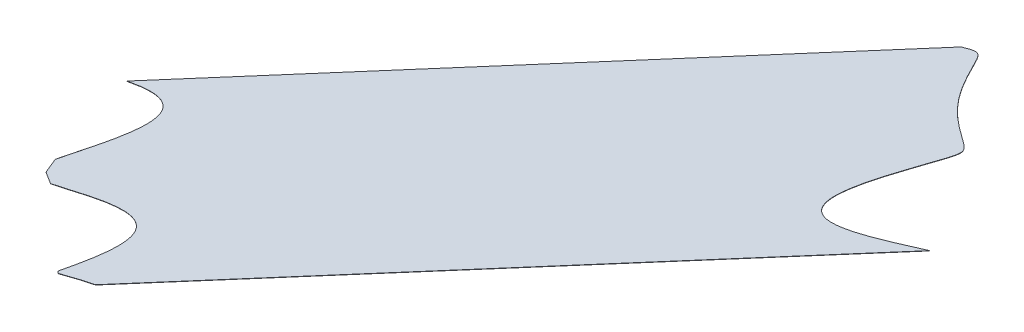
ISO-10303-21;
HEADER;
FILE_DESCRIPTION(('STEP AP214'),'2;1');
FILE_NAME('part.step','',(''),(''),'','','');
FILE_SCHEMA(('AUTOMOTIVE_DESIGN { 1 0 10303 214 1 1 1 1 }'));
ENDSEC;
DATA;
#1=APPLICATION_CONTEXT('core data for automotive mechanical design processes');
#2=APPLICATION_PROTOCOL_DEFINITION('international standard','automotive_design',2000,#1);
#3=PRODUCT_CONTEXT('',#1,'mechanical');
#4=PRODUCT('Part','Part','',(#3));
#5=PRODUCT_RELATED_PRODUCT_CATEGORY('part','',(#4));
#6=PRODUCT_DEFINITION_FORMATION('','',#4);
#7=PRODUCT_DEFINITION_CONTEXT('part definition',#1,'design');
#8=PRODUCT_DEFINITION('design','',#6,#7);
#9=PRODUCT_DEFINITION_SHAPE('','',#8);
#10=(LENGTH_UNIT() NAMED_UNIT(*) SI_UNIT(.MILLI.,.METRE.));
#11=(NAMED_UNIT(*) PLANE_ANGLE_UNIT() SI_UNIT($,.RADIAN.));
#12=(NAMED_UNIT(*) SI_UNIT($,.STERADIAN.) SOLID_ANGLE_UNIT());
#13=UNCERTAINTY_MEASURE_WITH_UNIT(LENGTH_MEASURE(1.E-05),#10,'distance_accuracy_value','');
#14=(GEOMETRIC_REPRESENTATION_CONTEXT(3) GLOBAL_UNCERTAINTY_ASSIGNED_CONTEXT((#13)) GLOBAL_UNIT_ASSIGNED_CONTEXT((#10,
#11,#12)) REPRESENTATION_CONTEXT('',''));
#15=CARTESIAN_POINT('',(0.,0.,0.));
#16=DIRECTION('',(0.,0.,1.));
#17=DIRECTION('',(1.,0.,0.));
#18=AXIS2_PLACEMENT_3D('',#15,#16,#17);
#19=CARTESIAN_POINT('',(2526.18612442201,154.997925680806,134.147987479624));
#20=DIRECTION('',(-0.636420404011801,0.0609268060007244,-0.76893237262324));
#21=DIRECTION('',(-0.770363525853528,0.,0.637604923157374));
#22=AXIS2_PLACEMENT_3D('',#19,#20,#21);
#23=PLANE('',#22);
#24=DIRECTION('',(0.769416763227082,0.120539805596336,-0.627270276461398));
#25=VECTOR('',#24,1.);
#26=CARTESIAN_POINT('',(2526.19157136044,154.898841974801,134.13562826986));
#27=LINE('',#26,#25);
#28=CARTESIAN_POINT('',(2526.19157136044,154.898841974801,134.13562826986));
#29=VERTEX_POINT('',#28);
#30=CARTESIAN_POINT('',(2684.13136642013,179.642301049661,5.37454111102499));
#31=VERTEX_POINT('',#30);
#32=EDGE_CURVE('E161',#29,#31,#27,.T.);
#33=ORIENTED_EDGE('',*,*,#32,.F.);
#34=DIRECTION('',(0.0544693842687489,-0.990837060054451,-0.123592097643965));
#35=VECTOR('',#34,1.);
#36=CARTESIAN_POINT('',(2526.18612442201,154.997925680806,134.147987479624));
#37=LINE('',#36,#35);
#38=CARTESIAN_POINT('',(2526.18612442201,154.997925680806,134.147987479624));
#39=VERTEX_POINT('',#38);
#40=EDGE_CURVE('E13',#39,#29,#37,.T.);
#41=ORIENTED_EDGE('',*,*,#40,.F.);
#42=DIRECTION('',(0.769416763227082,0.120539805596336,-0.627270276461398));
#43=VECTOR('',#42,1.);
#44=CARTESIAN_POINT('',(2526.18612442201,154.997925680806,134.147987479624));
#45=LINE('',#44,#43);
#46=CARTESIAN_POINT('',(2684.1259194817,179.741384755666,5.38690032078939));
#47=VERTEX_POINT('',#46);
#48=EDGE_CURVE('E227',#39,#47,#45,.T.);
#49=ORIENTED_EDGE('',*,*,#48,.T.);
#50=DIRECTION('',(0.0544693842687489,-0.990837060054451,-0.123592097643965));
#51=VECTOR('',#50,1.);
#52=CARTESIAN_POINT('',(2684.1259194817,179.741384755666,5.38690032078939));
#53=LINE('',#52,#51);
#54=EDGE_CURVE('E110',#47,#31,#53,.T.);
#55=ORIENTED_EDGE('',*,*,#54,.T.);
#56=EDGE_LOOP('',(#33,#41,#49,#55));
#57=FACE_BOUND('',#56,.T.);
#58=ADVANCED_FACE('F56',(#57),#23,.T.);
#59=CARTESIAN_POINT('',(2526.18612442201,154.997925680806,134.147987479624));
#60=CARTESIAN_POINT('',(2527.74584101399,155.113006093001,133.912785266505));
#61=CARTESIAN_POINT('',(2529.12018096937,155.205204682554,133.779327476054));
#62=CARTESIAN_POINT('',(2530.70036815862,155.311212682619,133.62588051415));
#63=CARTESIAN_POINT('',(2532.06566331949,155.389004789134,133.603933193824));
#64=CARTESIAN_POINT('',(2533.69095169273,155.48161084962,133.577806444406));
#65=CARTESIAN_POINT('',(2535.03808710249,155.535734204732,133.737608006263));
#66=CARTESIAN_POINT('',(2536.68012895446,155.601705905586,133.93239232466));
#67=CARTESIAN_POINT('',(2537.9351944785,155.611540457041,134.406679996598));
#68=CARTESIAN_POINT('',(2539.46409484854,155.623520747368,134.984449510008));
#69=CARTESIAN_POINT('',(2540.96744021771,155.514491135964,136.52109206115));
#70=CARTESIAN_POINT('',(2541.69378000524,155.394076599676,137.806566368557));
#71=CARTESIAN_POINT('',(2541.91270004164,155.313259191527,138.550961232247));
#72=CARTESIAN_POINT('',(2542.29045114621,155.173807062343,139.835430148932));
#73=CARTESIAN_POINT('',(2542.26598324431,154.967227528617,141.4807934868));
#74=CARTESIAN_POINT('',(2542.24608597631,154.799237303549,142.818800947956));
#75=CARTESIAN_POINT('',(2541.96009800397,154.584627551489,144.413285634158));
#76=CARTESIAN_POINT('',(2541.72191587425,154.405892035492,145.741235740815));
#77=CARTESIAN_POINT('',(2541.29605020046,154.192464781245,147.26459359047));
#78=CARTESIAN_POINT('',(2540.92753432657,154.007779008354,148.582806312858));
#79=CARTESIAN_POINT('',(2540.41278524443,153.794282185848,150.067549284975));
#80=CARTESIAN_POINT('',(2539.96429749972,153.608267850416,151.361167962774));
#81=CARTESIAN_POINT('',(2539.39542158973,153.39652432958,152.808000005733));
#82=CARTESIAN_POINT('',(2538.8977102795,153.211269261939,154.073837878486));
#83=CARTESIAN_POINT('',(2538.29048479369,152.999915775266,155.500641633774));
#84=CARTESIAN_POINT('',(2537.76966199564,152.818635975788,156.724424135426));
#85=CARTESIAN_POINT('',(2537.12523626788,152.603322511122,158.166580156076));
#86=CARTESIAN_POINT('',(2536.85054073258,152.511542116756,158.781319454977));
#87=CARTESIAN_POINT('',(2536.52703786203,152.404756606465,159.494844353294));
#88=CARTESIAN_POINT('',(2536.28130634098,152.323642748574,160.036835088245));
#89=CARTESIAN_POINT('',(2535.92238754405,152.205880023118,160.822755779413));
#90=CARTESIAN_POINT('',(2535.36763722174,152.023864173122,162.037486689209));
#91=CARTESIAN_POINT('',(2535.31510150696,152.006593612383,162.152791177626));
#92=CARTESIAN_POINT('',(2534.95369623408,151.887785450319,162.945997290264));
#93=CARTESIAN_POINT('',(2534.71116529873,151.806868094609,163.487823227367));
#94=CARTESIAN_POINT('',(2534.36646628782,151.691863662543,164.2578976277));
#95=CARTESIAN_POINT('',(2534.12268133216,151.607112846838,164.829903718617));
#96=CARTESIAN_POINT('',(2533.78774337376,151.490673072658,165.615787128729));
#97=CARTESIAN_POINT('',(2533.57448051185,151.407438692909,166.18908762853));
#98=B_SPLINE_CURVE_WITH_KNOTS('',2,(#59,#60,#61,#62,#63,#64,#65,#66,#67,#68,#69,#70,#71,#72,#73,
#74,#75,#76,#77,#78,#79,#80,#81,#82,#83,#84,#85,#86,#87,#88,#89,#90,#91,#92,#93,#94,#95,#96,
#97),.UNSPECIFIED.,.F.,.F.,(3,2,2,2,2,1,1,2,2,2,2,2,2,2,2,2,2,2,2,2,3),(0.,0.0625,0.125,0.1875,
0.25,0.3125,0.34375,0.375,0.4375,0.5,0.5625,0.625,0.6875,0.75,0.8125,0.84375,0.875,0.90625,
0.9375,0.96875,1.),.UNSPECIFIED.);
#99=DIRECTION('',(0.0544693842687489,-0.990837060054451,-0.123592097643965));
#100=VECTOR('',#99,1.);
#101=SURFACE_OF_LINEAR_EXTRUSION('',#98,#100);
#102=CARTESIAN_POINT('',(2526.19157136044,154.898841974801,134.13562826986));
#103=CARTESIAN_POINT('',(2527.75128795242,155.013922386995,133.90042605674));
#104=CARTESIAN_POINT('',(2529.12562790779,155.106120976548,133.76696826629));
#105=CARTESIAN_POINT('',(2530.70581509704,155.212128976613,133.613521304386));
#106=CARTESIAN_POINT('',(2532.07111025791,155.289921083128,133.59157398406));
#107=CARTESIAN_POINT('',(2533.69639863116,155.382527143614,133.565447234641));
#108=CARTESIAN_POINT('',(2535.04353404092,155.436650498726,133.725248796498));
#109=CARTESIAN_POINT('',(2536.68557589288,155.50262219958,133.920033114895));
#110=CARTESIAN_POINT('',(2537.94064141693,155.512456751035,134.394320786834));
#111=CARTESIAN_POINT('',(2539.46954178697,155.524437041363,134.972090300244));
#112=CARTESIAN_POINT('',(2540.97288715614,155.415407429959,136.508732851386));
#113=CARTESIAN_POINT('',(2541.69922694367,155.294992893671,137.794207158792));
#114=CARTESIAN_POINT('',(2541.91814698007,155.214175485521,138.538602022482));
#115=CARTESIAN_POINT('',(2542.29589808464,155.074723356338,139.823070939167));
#116=CARTESIAN_POINT('',(2542.27143018274,154.868143822612,141.468434277035));
#117=CARTESIAN_POINT('',(2542.25153291474,154.700153597544,142.806441738192));
#118=CARTESIAN_POINT('',(2541.9655449424,154.485543845484,144.400926424394));
#119=CARTESIAN_POINT('',(2541.72736281267,154.306808329486,145.72887653105));
#120=CARTESIAN_POINT('',(2541.30149713889,154.093381075239,147.252234380706));
#121=CARTESIAN_POINT('',(2540.932981265,153.908695302348,148.570447103094));
#122=CARTESIAN_POINT('',(2540.41823218286,153.695198479842,150.05519007521));
#123=CARTESIAN_POINT('',(2539.96974443815,153.509184144411,151.348808753009));
#124=CARTESIAN_POINT('',(2539.40086852815,153.297440623575,152.795640795968));
#125=CARTESIAN_POINT('',(2538.90315721793,153.112185555933,154.061478668722));
#126=CARTESIAN_POINT('',(2538.29593173211,152.90083206926,155.48828242401));
#127=CARTESIAN_POINT('',(2537.77510893406,152.719552269782,156.712064925662));
#128=CARTESIAN_POINT('',(2537.13068320631,152.504238805116,158.154220946312));
#129=CARTESIAN_POINT('',(2536.85598767101,152.41245841075,158.768960245212));
#130=CARTESIAN_POINT('',(2536.53248480046,152.30567290046,159.48248514353));
#131=CARTESIAN_POINT('',(2536.28675327941,152.224559042568,160.024475878481));
#132=CARTESIAN_POINT('',(2535.92783448248,152.106796317113,160.810396569649));
#133=CARTESIAN_POINT('',(2535.37308416017,151.924780467116,162.025127479444));
#134=CARTESIAN_POINT('',(2535.32054844538,151.907509906378,162.140431967862));
#135=CARTESIAN_POINT('',(2534.95914317251,151.788701744314,162.933638080499));
#136=CARTESIAN_POINT('',(2534.71661223716,151.707784388603,163.475464017602));
#137=CARTESIAN_POINT('',(2534.37191322624,151.592779956537,164.245538417935));
#138=CARTESIAN_POINT('',(2534.12812827059,151.508029140833,164.817544508853));
#139=CARTESIAN_POINT('',(2533.79319031218,151.391589366653,165.603427918964));
#140=CARTESIAN_POINT('',(2533.57992745027,151.308354986904,166.176728418765));
#141=B_SPLINE_CURVE_WITH_KNOTS('',2,(#102,#103,#104,#105,#106,#107,#108,#109,#110,#111,#112,
#113,#114,#115,#116,#117,#118,#119,#120,#121,#122,#123,#124,#125,#126,#127,#128,#129,#130,#131,
#132,#133,#134,#135,#136,#137,#138,#139,#140),.UNSPECIFIED.,.F.,.F.,(3,2,2,2,2,1,1,2,2,2,2,2,2,
2,2,2,2,2,2,2,3),(0.,0.0625,0.125,0.1875,0.25,0.3125,0.34375,0.375,0.4375,0.5,0.5625,0.625,
0.6875,0.75,0.8125,0.84375,0.875,0.90625,0.9375,0.96875,1.),.UNSPECIFIED.);
#142=CARTESIAN_POINT('',(2533.57992771344,151.308354910784,166.176729144992));
#143=VERTEX_POINT('',#142);
#144=EDGE_CURVE('E263',#29,#143,#141,.T.);
#145=ORIENTED_EDGE('',*,*,#144,.T.);
#146=DIRECTION('',(0.0544693842687489,-0.990837060054451,-0.123592097643965));
#147=VECTOR('',#146,1.);
#148=CARTESIAN_POINT('',(2533.57448077501,151.40743861679,166.189088354756));
#149=LINE('',#148,#147);
#150=CARTESIAN_POINT('',(2533.57448077501,151.40743861679,166.189088354756));
#151=VERTEX_POINT('',#150);
#152=EDGE_CURVE('E64',#151,#143,#149,.T.);
#153=ORIENTED_EDGE('',*,*,#152,.F.);
#154=EDGE_CURVE('E222',#39,#151,#98,.T.);
#155=ORIENTED_EDGE('',*,*,#154,.F.);
#156=ORIENTED_EDGE('',*,*,#40,.T.);
#157=EDGE_LOOP('',(#145,#153,#155,#156));
#158=FACE_BOUND('',#157,.T.);
#159=ADVANCED_FACE('F218',(#158),#101,.F.);
#160=CARTESIAN_POINT('',(2533.57448051187,151.407438692909,166.189087628538));
#161=CARTESIAN_POINT('',(2533.76626225872,151.351960366577,166.718378875083));
#162=CARTESIAN_POINT('',(2533.99091877641,151.283377034287,167.367221406714));
#163=CARTESIAN_POINT('',(2534.01006938824,151.277516302524,167.42264689423));
#164=CARTESIAN_POINT('',(2534.16452147991,151.230151542958,167.870439839778));
#165=CARTESIAN_POINT('',(2534.40426638145,151.154934331796,168.579115873374));
#166=CARTESIAN_POINT('',(2534.42442009463,151.148606602332,168.638727364295));
#167=CARTESIAN_POINT('',(2534.57041701832,151.10277069501,169.070537158055));
#168=CARTESIAN_POINT('',(2534.6210109543,151.086947113548,169.219692418202));
#169=CARTESIAN_POINT('',(2534.62932022373,151.084350004354,169.244175478896));
#170=CARTESIAN_POINT('',(2534.74268764328,151.048945215253,169.57797862222));
#171=CARTESIAN_POINT('',(2534.82880881869,151.022575506843,169.827339644));
#172=CARTESIAN_POINT('',(2534.84578512168,151.017384765607,169.876435562528));
#173=CARTESIAN_POINT('',(2535.09716485421,150.940874538191,170.600605390144));
#174=CARTESIAN_POINT('',(2535.27382035103,150.893559613618,171.057784271131));
#175=B_SPLINE_CURVE_WITH_KNOTS('',2,(#160,#161,#162,#163,#164,#165,#166,#167,#168,#169,#170,
#171,#172,#173,#174),.UNSPECIFIED.,.F.,.F.,(3,1,1,1,1,1,1,1,1,1,1,1,1,3),(0.,0.2375,0.25,0.2625,
0.488125,0.5,0.50625,0.6190625,0.625,0.63125,0.7440625,0.75,0.7625,1.),.UNSPECIFIED.);
#176=DIRECTION('',(0.0544693842687489,-0.990837060054451,-0.123592097643965));
#177=VECTOR('',#176,1.);
#178=SURFACE_OF_LINEAR_EXTRUSION('',#175,#177);
#179=CARTESIAN_POINT('',(2533.5799274503,151.308354986904,166.176728418773));
#180=CARTESIAN_POINT('',(2533.77170919715,151.252876660571,166.706019665318));
#181=CARTESIAN_POINT('',(2533.99636571484,151.184293328282,167.35486219695));
#182=CARTESIAN_POINT('',(2534.01551632667,151.178432596518,167.410287684466));
#183=CARTESIAN_POINT('',(2534.16996841834,151.131067836953,167.858080630014));
#184=CARTESIAN_POINT('',(2534.40971331988,151.05585062579,168.56675666361));
#185=CARTESIAN_POINT('',(2534.42986703306,151.049522896326,168.626368154531));
#186=CARTESIAN_POINT('',(2534.57586395675,151.003686989005,169.05817794829));
#187=CARTESIAN_POINT('',(2534.62645789273,150.987863407542,169.207333208438));
#188=CARTESIAN_POINT('',(2534.63476716215,150.985266298348,169.231816269131));
#189=CARTESIAN_POINT('',(2534.74813458171,150.949861509247,169.565619412456));
#190=CARTESIAN_POINT('',(2534.83425575712,150.923491800838,169.814980434235));
#191=CARTESIAN_POINT('',(2534.85123206011,150.918301059602,169.864076352764));
#192=CARTESIAN_POINT('',(2535.10261179264,150.841790832186,170.58824618038));
#193=CARTESIAN_POINT('',(2535.27926728946,150.794475907613,171.045425061367));
#194=B_SPLINE_CURVE_WITH_KNOTS('',2,(#179,#180,#181,#182,#183,#184,#185,#186,#187,#188,#189,
#190,#191,#192,#193),.UNSPECIFIED.,.F.,.F.,(3,1,1,1,1,1,1,1,1,1,1,1,1,3),(0.,0.2375,0.25,0.2625,
0.488125,0.5,0.50625,0.6190625,0.625,0.63125,0.7440625,0.75,0.7625,1.),.UNSPECIFIED.);
#195=CARTESIAN_POINT('',(2535.27926698278,150.794475989751,171.045424267712));
#196=VERTEX_POINT('',#195);
#197=EDGE_CURVE('E259',#143,#196,#194,.T.);
#198=ORIENTED_EDGE('',*,*,#197,.T.);
#199=DIRECTION('',(0.0544693842687489,-0.990837060054451,-0.123592097643965));
#200=VECTOR('',#199,1.);
#201=CARTESIAN_POINT('',(2535.27382004436,150.893559695756,171.057783477477));
#202=LINE('',#201,#200);
#203=CARTESIAN_POINT('',(2535.27382004436,150.893559695756,171.057783477477));
#204=VERTEX_POINT('',#203);
#205=EDGE_CURVE('E252',#204,#196,#202,.T.);
#206=ORIENTED_EDGE('',*,*,#205,.F.);
#207=EDGE_CURVE('E204',#151,#204,#175,.T.);
#208=ORIENTED_EDGE('',*,*,#207,.F.);
#209=ORIENTED_EDGE('',*,*,#152,.T.);
#210=EDGE_LOOP('',(#198,#206,#208,#209));
#211=FACE_BOUND('',#210,.T.);
#212=ADVANCED_FACE('F215',(#211),#178,.F.);
#213=CARTESIAN_POINT('',(2535.27382035103,150.893559613618,171.057784271132));
#214=CARTESIAN_POINT('',(2535.6607692615,150.883167305677,171.311635070193));
#215=CARTESIAN_POINT('',(2536.25915119824,150.869983610078,171.681046955826));
#216=CARTESIAN_POINT('',(2536.30486293245,150.868984248934,171.709204857018));
#217=CARTESIAN_POINT('',(2536.62973304053,150.861918152612,171.909030131704));
#218=CARTESIAN_POINT('',(2537.93554082923,150.834749421358,172.70233596512));
#219=CARTESIAN_POINT('',(2538.32193767474,150.826395492039,172.939601790233));
#220=CARTESIAN_POINT('',(2538.36815729251,150.825392547848,172.968012250622));
#221=CARTESIAN_POINT('',(2538.91766945873,150.813418116256,173.30619163857));
#222=CARTESIAN_POINT('',(2539.36175477393,150.802826477522,173.58682156983));
#223=B_SPLINE_CURVE_WITH_KNOTS('',2,(#213,#214,#215,#216,#217,#218,#219,#220,#221,#222),
.UNSPECIFIED.,.F.,.F.,(3,1,1,1,1,1,1,1,3),(0.,0.2375,0.25,0.2625,0.5,0.7375,0.75,0.7625,1.),.UNSPECIFIED.);
#224=DIRECTION('',(0.0544693842687489,-0.990837060054451,-0.123592097643965));
#225=VECTOR('',#224,1.);
#226=SURFACE_OF_LINEAR_EXTRUSION('',#223,#225);
#227=CARTESIAN_POINT('',(2535.27926728946,150.794475907613,171.045425061367));
#228=CARTESIAN_POINT('',(2535.66621619993,150.784083599672,171.299275860428));
#229=CARTESIAN_POINT('',(2536.26459813667,150.770899904073,171.668687746061));
#230=CARTESIAN_POINT('',(2536.31030987087,150.769900542929,171.696845647253));
#231=CARTESIAN_POINT('',(2536.63517997895,150.762834446606,171.896670921939));
#232=CARTESIAN_POINT('',(2537.94098776766,150.735665715352,172.689976755356));
#233=CARTESIAN_POINT('',(2538.32738461317,150.727311786033,172.927242580469));
#234=CARTESIAN_POINT('',(2538.37360423094,150.726308841842,172.955653040857));
#235=CARTESIAN_POINT('',(2538.92311639716,150.714334410251,173.293832428805));
#236=CARTESIAN_POINT('',(2539.36720171236,150.703742771516,173.574462360066));
#237=B_SPLINE_CURVE_WITH_KNOTS('',2,(#227,#228,#229,#230,#231,#232,#233,#234,#235,#236),
.UNSPECIFIED.,.F.,.F.,(3,1,1,1,1,1,1,1,3),(0.,0.2375,0.25,0.2625,0.5,0.7375,0.75,0.7625,1.),.UNSPECIFIED.);
#238=CARTESIAN_POINT('',(2539.36720104685,150.703742787389,173.574461939516));
#239=VERTEX_POINT('',#238);
#240=EDGE_CURVE('E265',#196,#239,#237,.T.);
#241=ORIENTED_EDGE('',*,*,#240,.T.);
#242=DIRECTION('',(0.0544693842687489,-0.990837060054451,-0.123592097643965));
#243=VECTOR('',#242,1.);
#244=CARTESIAN_POINT('',(2539.36175410843,150.802826493394,173.58682114928));
#245=LINE('',#244,#243);
#246=CARTESIAN_POINT('',(2539.36175410843,150.802826493394,173.58682114928));
#247=VERTEX_POINT('',#246);
#248=EDGE_CURVE('E249',#247,#239,#245,.T.);
#249=ORIENTED_EDGE('',*,*,#248,.F.);
#250=EDGE_CURVE('E196',#204,#247,#223,.T.);
#251=ORIENTED_EDGE('',*,*,#250,.F.);
#252=ORIENTED_EDGE('',*,*,#205,.T.);
#253=EDGE_LOOP('',(#241,#249,#251,#252));
#254=FACE_BOUND('',#253,.T.);
#255=ADVANCED_FACE('F212',(#254),#226,.F.);
#256=CARTESIAN_POINT('',(2539.36175477393,150.802826477522,173.58682156983));
#257=CARTESIAN_POINT('',(2540.04754033345,150.850757736676,173.504795688478));
#258=CARTESIAN_POINT('',(2541.06805848064,150.929421063225,173.323914025926));
#259=CARTESIAN_POINT('',(2541.75368615666,150.98227044559,173.20238999985));
#260=CARTESIAN_POINT('',(2542.76110458592,151.062181218749,173.005734271334));
#261=CARTESIAN_POINT('',(2543.29369163548,151.104427262368,172.901769234376));
#262=CARTESIAN_POINT('',(2545.55879706965,151.285253851179,172.450358598926));
#263=CARTESIAN_POINT('',(2546.14119149716,151.331537527037,172.335974947236));
#264=CARTESIAN_POINT('',(2547.06492635063,151.404947989978,172.154551223483));
#265=CARTESIAN_POINT('',(2547.83543458176,151.465455527226,172.009040290849));
#266=CARTESIAN_POINT('',(2548.72821008628,151.535564638215,171.840439111723));
#267=CARTESIAN_POINT('',(2549.52875964595,151.597290728696,171.698398829501));
#268=CARTESIAN_POINT('',(2551.3583366212,151.738359613882,171.373779789024));
#269=CARTESIAN_POINT('',(2552.91846367646,151.851929441804,171.150868819358));
#270=CARTESIAN_POINT('',(2554.75192723309,151.985396866734,170.888903527571));
#271=CARTESIAN_POINT('',(2556.33346252007,152.089726639016,170.74950503939));
#272=CARTESIAN_POINT('',(2558.20733176083,152.213340922417,170.584339872758));
#273=CARTESIAN_POINT('',(2559.79267111459,152.300382223502,170.585219472572));
#274=CARTESIAN_POINT('',(2561.705373419,152.405397024762,170.586280704408));
#275=CARTESIAN_POINT('',(2563.24704444886,152.459872250901,170.828996860208));
#276=CARTESIAN_POINT('',(2565.17115950817,152.527861206355,171.131923879962));
#277=CARTESIAN_POINT('',(2566.56288814662,152.518693818805,171.818780005493));
#278=CARTESIAN_POINT('',(2567.38489730682,152.513279202526,172.224463995411));
#279=CARTESIAN_POINT('',(2568.36123431701,152.464369999202,173.046859026753));
#280=CARTESIAN_POINT('',(2568.93677505591,152.416456080781,173.684636338054));
#281=CARTESIAN_POINT('',(2569.35784934826,152.36174520418,174.308828523727));
#282=CARTESIAN_POINT('',(2570.13419403967,152.223883767508,175.756212631108));
#283=CARTESIAN_POINT('',(2570.34315914198,152.045137779755,177.281312965607));
#284=CARTESIAN_POINT('',(2570.55167537407,151.866775749659,178.803137288386));
#285=CARTESIAN_POINT('',(2570.35063510306,151.617387213156,180.713881333081));
#286=CARTESIAN_POINT('',(2570.18794556386,151.415572393264,182.260129090285));
#287=CARTESIAN_POINT('',(2569.75393894397,151.163356490746,184.090867416677));
#288=CARTESIAN_POINT('',(2569.39279850794,150.953485588239,185.614239658392));
#289=CARTESIAN_POINT('',(2568.83541890139,150.703918415677,187.369370315684));
#290=CARTESIAN_POINT('',(2568.35771892067,150.490027860444,188.873598083073));
#291=CARTESIAN_POINT('',(2567.71885410732,150.239487207768,190.600621046329));
#292=CARTESIAN_POINT('',(2567.1809177512,150.028527200351,192.054807316081));
#293=CARTESIAN_POINT('',(2566.48619047314,149.775186222548,193.779660819104));
#294=CARTESIAN_POINT('',(2566.19204951529,149.667924048991,194.50994747627));
#295=CARTESIAN_POINT('',(2565.8437696694,149.543537735931,195.353658214834));
#296=CARTESIAN_POINT('',(2565.57554919918,149.447744207335,196.003424469445));
#297=CARTESIAN_POINT('',(2565.19123690568,149.311938496001,196.922804267415));
#298=B_SPLINE_CURVE_WITH_KNOTS('',2,(#256,#257,#258,#259,#260,#261,#262,#263,#264,#265,#266,
#267,#268,#269,#270,#271,#272,#273,#274,#275,#276,#277,#278,#279,#280,#281,#282,#283,#284,#285,
#286,#287,#288,#289,#290,#291,#292,#293,#294,#295,#296,#297),.UNSPECIFIED.,.F.,.F.,(3,2,2,1,2,2,
2,2,2,2,2,2,1,1,1,1,2,2,2,2,2,2,2,3),(0.,0.03125,0.0625,0.09375,0.125,0.15625,0.1875,0.25,
0.3125,0.375,0.4375,0.5,0.53125,0.546875,0.5625,0.573954582214355,0.625,0.6875,0.75,0.8125,
0.875,0.9375,0.96875,1.),.UNSPECIFIED.);
#299=DIRECTION('',(0.0544693842687489,-0.990837060054451,-0.123592097643965));
#300=VECTOR('',#299,1.);
#301=SURFACE_OF_LINEAR_EXTRUSION('',#298,#300);
#302=CARTESIAN_POINT('',(2539.36720171236,150.703742771516,173.574462360066));
#303=CARTESIAN_POINT('',(2540.05298727187,150.75167403067,173.492436478714));
#304=CARTESIAN_POINT('',(2541.07350541907,150.83033735722,173.311554816162));
#305=CARTESIAN_POINT('',(2541.75913309509,150.883186739584,173.190030790086));
#306=CARTESIAN_POINT('',(2542.76655152435,150.963097512743,172.99337506157));
#307=CARTESIAN_POINT('',(2543.29913857391,151.005343556363,172.889410024612));
#308=CARTESIAN_POINT('',(2545.56424400807,151.186170145173,172.437999389162));
#309=CARTESIAN_POINT('',(2546.14663843559,151.232453821032,172.323615737472));
#310=CARTESIAN_POINT('',(2547.07037328905,151.305864283972,172.142192013719));
#311=CARTESIAN_POINT('',(2547.84088152019,151.36637182122,171.996681081085));
#312=CARTESIAN_POINT('',(2548.73365702471,151.436480932209,171.828079901959));
#313=CARTESIAN_POINT('',(2549.53420658438,151.498207022691,171.686039619737));
#314=CARTESIAN_POINT('',(2551.36378355963,151.639275907876,171.36142057926));
#315=CARTESIAN_POINT('',(2552.92391061489,151.752845735799,171.138509609594));
#316=CARTESIAN_POINT('',(2554.75737417152,151.886313160729,170.876544317807));
#317=CARTESIAN_POINT('',(2556.3389094585,151.990642933011,170.737145829626));
#318=CARTESIAN_POINT('',(2558.21277869925,152.114257216412,170.571980662994));
#319=CARTESIAN_POINT('',(2559.79811805302,152.201298517497,170.572860262808));
#320=CARTESIAN_POINT('',(2561.71082035743,152.306313318756,170.573921494643));
#321=CARTESIAN_POINT('',(2563.25249138729,152.360788544896,170.816637650444));
#322=CARTESIAN_POINT('',(2565.1766064466,152.42877750035,171.119564670197));
#323=CARTESIAN_POINT('',(2566.56833508505,152.4196101128,171.806420795728));
#324=CARTESIAN_POINT('',(2567.39034424525,152.414195496521,172.212104785647));
#325=CARTESIAN_POINT('',(2568.36668125543,152.365286293196,173.034499816989));
#326=CARTESIAN_POINT('',(2568.94222199434,152.317372374775,173.67227712829));
#327=CARTESIAN_POINT('',(2569.36329628669,152.262661498174,174.296469313963));
#328=CARTESIAN_POINT('',(2570.1396409781,152.124800061503,175.743853421344));
#329=CARTESIAN_POINT('',(2570.34860608041,151.94605407375,177.268953755843));
#330=CARTESIAN_POINT('',(2570.5571223125,151.767692043654,178.790778078622));
#331=CARTESIAN_POINT('',(2570.35608204149,151.518303507151,180.701522123317));
#332=CARTESIAN_POINT('',(2570.19339250229,151.316488687258,182.247769880521));
#333=CARTESIAN_POINT('',(2569.7593858824,151.06427278474,184.078508206913));
#334=CARTESIAN_POINT('',(2569.39824544636,150.854401882233,185.601880448628));
#335=CARTESIAN_POINT('',(2568.84086583982,150.604834709672,187.35701110592));
#336=CARTESIAN_POINT('',(2568.3631658591,150.390944154439,188.861238873308));
#337=CARTESIAN_POINT('',(2567.72430104575,150.140403501762,190.588261836564));
#338=CARTESIAN_POINT('',(2567.18636468963,149.929443494346,192.042448106317));
#339=CARTESIAN_POINT('',(2566.49163741157,149.676102516543,193.76730160934));
#340=CARTESIAN_POINT('',(2566.19749645372,149.568840342985,194.497588266506));
#341=CARTESIAN_POINT('',(2565.84921660782,149.444454029926,195.34129900507));
#342=CARTESIAN_POINT('',(2565.58099613761,149.348660501329,195.991065259681));
#343=CARTESIAN_POINT('',(2565.19668384411,149.212854789996,196.91044505765));
#344=B_SPLINE_CURVE_WITH_KNOTS('',2,(#302,#303,#304,#305,#306,#307,#308,#309,#310,#311,#312,
#313,#314,#315,#316,#317,#318,#319,#320,#321,#322,#323,#324,#325,#326,#327,#328,#329,#330,#331,
#332,#333,#334,#335,#336,#337,#338,#339,#340,#341,#342,#343),.UNSPECIFIED.,.F.,.F.,(3,2,2,1,2,2,
2,2,2,2,2,2,1,1,1,1,2,2,2,2,2,2,2,3),(0.,0.03125,0.0625,0.09375,0.125,0.15625,0.1875,0.25,
0.3125,0.375,0.4375,0.5,0.53125,0.546875,0.5625,0.573954582214355,0.625,0.6875,0.75,0.8125,
0.875,0.9375,0.96875,1.),.UNSPECIFIED.);
#345=CARTESIAN_POINT('',(2565.19668404952,149.212854862582,196.910444566254));
#346=VERTEX_POINT('',#345);
#347=EDGE_CURVE('E267',#239,#346,#344,.T.);
#348=ORIENTED_EDGE('',*,*,#347,.T.);
#349=DIRECTION('',(0.0544693842687489,-0.990837060054451,-0.123592097643965));
#350=VECTOR('',#349,1.);
#351=CARTESIAN_POINT('',(2565.19123711109,149.311938568588,196.922803776018));
#352=LINE('',#351,#350);
#353=CARTESIAN_POINT('',(2565.19123711109,149.311938568588,196.922803776018));
#354=VERTEX_POINT('',#353);
#355=EDGE_CURVE('E246',#354,#346,#352,.T.);
#356=ORIENTED_EDGE('',*,*,#355,.F.);
#357=EDGE_CURVE('E188',#247,#354,#298,.T.);
#358=ORIENTED_EDGE('',*,*,#357,.F.);
#359=ORIENTED_EDGE('',*,*,#248,.T.);
#360=EDGE_LOOP('',(#348,#356,#358,#359));
#361=FACE_BOUND('',#360,.T.);
#362=ADVANCED_FACE('F181',(#361),#301,.F.);
#363=CARTESIAN_POINT('',(2565.19123690568,149.311938496001,196.922804267414));
#364=CARTESIAN_POINT('',(2565.49088719377,149.292242113994,197.212771608476));
#365=CARTESIAN_POINT('',(2565.77566291156,149.27042532555,197.513182728866));
#366=B_SPLINE_CURVE_WITH_KNOTS('',2,(#363,#364,#365),.UNSPECIFIED.,.F.,.F.,(3,3),(0.,1.),.UNSPECIFIED.);
#367=DIRECTION('',(0.0544693842687489,-0.990837060054451,-0.123592097643965));
#368=VECTOR('',#367,1.);
#369=SURFACE_OF_LINEAR_EXTRUSION('',#366,#368);
#370=CARTESIAN_POINT('',(2565.19668384411,149.212854789996,196.91044505765));
#371=CARTESIAN_POINT('',(2565.4963341322,149.193158407988,197.200412398712));
#372=CARTESIAN_POINT('',(2565.78110984999,149.171341619544,197.500823519101));
#373=B_SPLINE_CURVE_WITH_KNOTS('',2,(#370,#371,#372),.UNSPECIFIED.,.F.,.F.,(3,3),(0.,1.),.UNSPECIFIED.);
#374=CARTESIAN_POINT('',(2565.78110945363,149.17134164991,197.500823100975));
#375=VERTEX_POINT('',#374);
#376=EDGE_CURVE('E285',#346,#375,#373,.T.);
#377=ORIENTED_EDGE('',*,*,#376,.T.);
#378=DIRECTION('',(0.0544693842687489,-0.990837060054451,-0.123592097643965));
#379=VECTOR('',#378,1.);
#380=CARTESIAN_POINT('',(2565.7756625152,149.270425355915,197.51318231074));
#381=LINE('',#380,#379);
#382=CARTESIAN_POINT('',(2565.7756625152,149.270425355915,197.51318231074));
#383=VERTEX_POINT('',#382);
#384=EDGE_CURVE('E147',#383,#375,#381,.T.);
#385=ORIENTED_EDGE('',*,*,#384,.F.);
#386=EDGE_CURVE('E138',#354,#383,#366,.T.);
#387=ORIENTED_EDGE('',*,*,#386,.F.);
#388=ORIENTED_EDGE('',*,*,#355,.T.);
#389=EDGE_LOOP('',(#377,#385,#387,#388));
#390=FACE_BOUND('',#389,.T.);
#391=ADVANCED_FACE('F178',(#390),#369,.F.);
#392=CARTESIAN_POINT('',(2565.77566291156,149.27042532555,197.513182728866));
#393=CARTESIAN_POINT('',(2566.6126485873,149.340729368809,197.318431142052));
#394=CARTESIAN_POINT('',(2567.09671843697,149.381299267134,197.206521299985));
#395=CARTESIAN_POINT('',(2567.15659615244,149.386316499791,197.192687423907));
#396=CARTESIAN_POINT('',(2567.8501940986,149.444418203527,197.032568220229));
#397=CARTESIAN_POINT('',(2568.43581695183,149.493188458347,196.899672509352));
#398=CARTESIAN_POINT('',(2568.53816494733,149.501708783308,196.876471823436));
#399=CARTESIAN_POINT('',(2569.92382093503,149.616951797862,196.563254214772));
#400=CARTESIAN_POINT('',(2571.09720297107,149.712527570259,196.314155600004));
#401=CARTESIAN_POINT('',(2571.22700307342,149.723086277229,196.286711883261));
#402=CARTESIAN_POINT('',(2572.58452627347,149.833336677126,196.001121380797));
#403=CARTESIAN_POINT('',(2573.79479549086,149.928394574631,195.772431447007));
#404=CARTESIAN_POINT('',(2573.92677102281,149.938739407601,195.747661109886));
#405=CARTESIAN_POINT('',(2575.35591173647,150.050489803685,195.481608345705));
#406=CARTESIAN_POINT('',(2576.57527125584,150.140899702065,195.294187659997));
#407=B_SPLINE_CURVE_WITH_KNOTS('',2,(#392,#393,#394,#395,#396,#397,#398,#399,#400,#401,#402,
#403,#404,#405,#406),.UNSPECIFIED.,.F.,.F.,(3,1,1,1,1,1,1,1,1,1,1,1,1,3),(0.,0.11875,0.125,
0.13125,0.2440625,0.25,0.2625,0.488125,0.5,0.5125,0.738125,0.75,0.7625,1.),.UNSPECIFIED.);
#408=DIRECTION('',(0.0544693842687489,-0.990837060054451,-0.123592097643965));
#409=VECTOR('',#408,1.);
#410=SURFACE_OF_LINEAR_EXTRUSION('',#407,#409);
#411=CARTESIAN_POINT('',(2565.78110984999,149.171341619544,197.500823519101));
#412=CARTESIAN_POINT('',(2566.61809552572,149.241645662804,197.306071932287));
#413=CARTESIAN_POINT('',(2567.1021653754,149.282215561128,197.194162090221));
#414=CARTESIAN_POINT('',(2567.16204309087,149.287232793786,197.180328214143));
#415=CARTESIAN_POINT('',(2567.85564103703,149.345334497521,197.020209010464));
#416=CARTESIAN_POINT('',(2568.44126389026,149.394104752341,196.887313299588));
#417=CARTESIAN_POINT('',(2568.54361188576,149.402625077302,196.864112613672));
#418=CARTESIAN_POINT('',(2569.92926787346,149.517868091856,196.550895005008));
#419=CARTESIAN_POINT('',(2571.1026499095,149.613443864253,196.30179639024));
#420=CARTESIAN_POINT('',(2571.23245001185,149.624002571224,196.274352673496));
#421=CARTESIAN_POINT('',(2572.58997321189,149.734252971121,195.988762171032));
#422=CARTESIAN_POINT('',(2573.80024242929,149.829310868625,195.760072237242));
#423=CARTESIAN_POINT('',(2573.93221796123,149.839655701596,195.735301900121));
#424=CARTESIAN_POINT('',(2575.36135867489,149.95140609768,195.46924913594));
#425=CARTESIAN_POINT('',(2576.58071819426,150.04181599606,195.281828450233));
#426=B_SPLINE_CURVE_WITH_KNOTS('',2,(#411,#412,#413,#414,#415,#416,#417,#418,#419,#420,#421,
#422,#423,#424,#425),.UNSPECIFIED.,.F.,.F.,(3,1,1,1,1,1,1,1,1,1,1,1,1,3),(0.,0.11875,0.125,
0.13125,0.2440625,0.25,0.2625,0.488125,0.5,0.5125,0.738125,0.75,0.7625,1.),.UNSPECIFIED.);
#427=CARTESIAN_POINT('',(2576.58071819426,150.04181599606,195.281828450233));
#428=VERTEX_POINT('',#427);
#429=EDGE_CURVE('E146',#375,#428,#426,.T.);
#430=ORIENTED_EDGE('',*,*,#429,.T.);
#431=DIRECTION('',(0.0544693842687489,-0.990837060054451,-0.123592097643965));
#432=VECTOR('',#431,1.);
#433=CARTESIAN_POINT('',(2576.57527125584,150.140899702065,195.294187659997));
#434=LINE('',#433,#432);
#435=CARTESIAN_POINT('',(2576.57527125584,150.140899702065,195.294187659997));
#436=VERTEX_POINT('',#435);
#437=EDGE_CURVE('E143',#436,#428,#434,.T.);
#438=ORIENTED_EDGE('',*,*,#437,.F.);
#439=EDGE_CURVE('E132',#383,#436,#407,.T.);
#440=ORIENTED_EDGE('',*,*,#439,.F.);
#441=ORIENTED_EDGE('',*,*,#384,.T.);
#442=EDGE_LOOP('',(#430,#438,#440,#441));
#443=FACE_BOUND('',#442,.T.);
#444=ADVANCED_FACE('F144',(#443),#410,.F.);
#445=CARTESIAN_POINT('',(2576.57527125584,150.140899702065,195.294187659997));
#446=DIRECTION('',(-0.636420404011801,0.0609268060007244,-0.76893237262324));
#447=DIRECTION('',(-0.770363525853528,0.,0.637604923157373));
#448=AXIS2_PLACEMENT_3D('',#445,#446,#447);
#449=PLANE('',#448);
#450=DIRECTION('',(0.769416763227082,0.120539805596337,-0.627270276461398));
#451=VECTOR('',#450,1.);
#452=CARTESIAN_POINT('',(2576.58071819426,150.04181599606,195.281828450232));
#453=LINE('',#452,#451);
#454=CARTESIAN_POINT('',(2734.4705644858,174.777449903741,66.5614622362806));
#455=VERTEX_POINT('',#454);
#456=EDGE_CURVE('E103',#428,#455,#453,.T.);
#457=ORIENTED_EDGE('',*,*,#456,.T.);
#458=DIRECTION('',(0.0544693842687489,-0.990837060054451,-0.123592097643965));
#459=VECTOR('',#458,1.);
#460=CARTESIAN_POINT('',(2734.46511754738,174.876533609746,66.573821446045));
#461=LINE('',#460,#459);
#462=CARTESIAN_POINT('',(2734.46511754738,174.876533609746,66.573821446045));
#463=VERTEX_POINT('',#462);
#464=EDGE_CURVE('E148',#463,#455,#461,.T.);
#465=ORIENTED_EDGE('',*,*,#464,.F.);
#466=DIRECTION('',(0.769416763227082,0.120539805596337,-0.627270276461398));
#467=VECTOR('',#466,1.);
#468=CARTESIAN_POINT('',(2576.57527125584,150.140899702065,195.294187659997));
#469=LINE('',#468,#467);
#470=EDGE_CURVE('E136',#436,#463,#469,.T.);
#471=ORIENTED_EDGE('',*,*,#470,.F.);
#472=ORIENTED_EDGE('',*,*,#437,.T.);
#473=EDGE_LOOP('',(#457,#465,#471,#472));
#474=FACE_BOUND('',#473,.T.);
#475=ADVANCED_FACE('F150',(#474),#449,.F.);
#476=CARTESIAN_POINT('',(2734.46511754738,174.876533609746,66.5738214460451));
#477=CARTESIAN_POINT('',(2733.75594981613,174.811970301317,66.7788813934893));
#478=CARTESIAN_POINT('',(2732.5281601543,174.697958808573,67.1518005871085));
#479=CARTESIAN_POINT('',(2732.03779119496,174.652289052795,67.3018198166676));
#480=CARTESIAN_POINT('',(2731.37851472717,174.590788083707,67.5043170362789));
#481=CARTESIAN_POINT('',(2730.05858124481,174.467257546012,67.9129408212894));
#482=CARTESIAN_POINT('',(2729.18159796098,174.385313213641,68.1833848264277));
#483=CARTESIAN_POINT('',(2728.19532400106,174.293156883333,68.4875318778031));
#484=CARTESIAN_POINT('',(2727.42614370487,174.221664495592,68.7216935330492));
#485=CARTESIAN_POINT('',(2725.48468895766,174.04121364908,69.3127308482883));
#486=CARTESIAN_POINT('',(2723.90860361127,173.897819004087,69.7677140646268));
#487=CARTESIAN_POINT('',(2722.01392693722,173.725438434927,70.3146680027887));
#488=CARTESIAN_POINT('',(2720.36820436271,173.581061238454,70.7468378793375));
#489=CARTESIAN_POINT('',(2718.45688321872,173.413383409517,71.2487544451268));
#490=CARTESIAN_POINT('',(2716.7839635836,173.274885550473,71.6218034498898));
#491=CARTESIAN_POINT('',(2714.836678907,173.113673527495,72.0560338787418));
#492=CARTESIAN_POINT('',(2713.15639538374,172.987339571216,72.3283195471401));
#493=CARTESIAN_POINT('',(2711.1630857832,172.837470406614,72.651330294668));
#494=CARTESIAN_POINT('',(2709.50314865721,172.733491312926,72.7533642155999));
#495=CARTESIAN_POINT('',(2707.39375521175,172.601358104232,72.8830255628025));
#496=CARTESIAN_POINT('',(2705.7803528566,172.540704199331,72.6582304781674));
#497=CARTESIAN_POINT('',(2704.76914001082,172.502688878734,72.5173383587734));
#498=CARTESIAN_POINT('',(2703.94376437772,172.49235669066,72.2364127305849));
#499=CARTESIAN_POINT('',(2702.98170986365,172.480313533849,71.9089669496826));
#500=CARTESIAN_POINT('',(2701.48891044801,172.533554803213,70.8242269835195));
#501=CARTESIAN_POINT('',(2700.76197597049,172.640309712404,69.6479997284201));
#502=CARTESIAN_POINT('',(2700.4235582297,172.729082909227,68.7871584501639));
#503=CARTESIAN_POINT('',(2700.2845456019,172.799994339544,68.157396459997));
#504=CARTESIAN_POINT('',(2699.9926146985,172.993050282646,66.4810087006184));
#505=CARTESIAN_POINT('',(2700.30899275791,173.264671465767,64.4428572229555));
#506=CARTESIAN_POINT('',(2700.55113031161,173.472554682882,62.8829734124421));
#507=CARTESIAN_POINT('',(2701.13714009062,173.740131426476,60.9960779994781));
#508=CARTESIAN_POINT('',(2701.63252423086,173.966327779886,59.4009884713374));
#509=CARTESIAN_POINT('',(2702.38162416339,174.23880665815,57.5466696034324));
#510=CARTESIAN_POINT('',(2703.0197166127,174.470907486444,55.9671381993704));
#511=CARTESIAN_POINT('',(2703.85459653861,174.741177088404,54.1683359574499));
#512=CARTESIAN_POINT('',(2704.57386957921,174.974022114795,52.6186161500661));
#513=CARTESIAN_POINT('',(2705.46059034147,175.242067951136,50.8604890639172));
#514=CARTESIAN_POINT('',(2706.22180146424,175.472173617676,49.3512135961765));
#515=CARTESIAN_POINT('',(2707.15243881097,175.742019159516,47.5980131551941));
#516=CARTESIAN_POINT('',(2707.88858560436,175.955470651695,46.2112077714002));
#517=CARTESIAN_POINT('',(2708.89965723757,176.242340922976,44.3569691002407));
#518=CARTESIAN_POINT('',(2709.15900255993,176.315924693439,43.8813468890177));
#519=CARTESIAN_POINT('',(2710.36302692305,176.656631198361,41.6805414074406));
#520=CARTESIAN_POINT('',(2710.66603213679,176.742862320664,41.1227672001956));
#521=CARTESIAN_POINT('',(2711.18140856793,176.889531374693,40.1740585071695));
#522=CARTESIAN_POINT('',(2711.53841145276,176.993317851346,39.4993409348386));
#523=CARTESIAN_POINT('',(2712.04246642331,177.139854732856,38.5467022853877));
#524=CARTESIAN_POINT('',(2712.37961711683,177.244067245775,37.8598199453602));
#525=CARTESIAN_POINT('',(2712.60306756191,177.313135270374,37.404580885969));
#526=CARTESIAN_POINT('',(2712.77316847358,177.36966263636,37.0263680544425));
#527=CARTESIAN_POINT('',(2712.9844582749,177.43987775638,36.5565733117494));
#528=CARTESIAN_POINT('',(2713.12667695523,177.495182167586,36.1758766721169));
#529=CARTESIAN_POINT('',(2713.3106732883,177.56673260555,35.6833479442372));
#530=CARTESIAN_POINT('',(2713.44799385245,177.65288385666,35.0531936926516));
#531=CARTESIAN_POINT('',(2713.48529305091,177.711901947715,34.5964844973765));
#532=CARTESIAN_POINT('',(2713.43475009617,177.765454577022,34.1448781692375));
#533=CARTESIAN_POINT('',(2713.28199741424,177.810407649438,33.7171686663494));
#534=CARTESIAN_POINT('',(2713.04249892962,177.846144070445,33.325118476726));
#535=CARTESIAN_POINT('',(2712.745802978,177.874293305371,32.9686866998014));
#536=CARTESIAN_POINT('',(2712.28607682005,177.906092696102,32.5111411393846));
#537=CARTESIAN_POINT('',(2711.87515739671,177.925251813601,32.1764426237243));
#538=CARTESIAN_POINT('',(2711.56417283552,177.939751468301,31.9231421830318));
#539=CARTESIAN_POINT('',(2711.14673116557,177.955562249152,31.6124127830298));
#540=CARTESIAN_POINT('',(2710.60357582318,177.976134488831,31.2081063953416));
#541=CARTESIAN_POINT('',(2709.65109249374,178.007188134447,30.5393720265374));
#542=CARTESIAN_POINT('',(2709.2717275355,178.019556503119,30.2730215529358));
#543=CARTESIAN_POINT('',(2708.46517800033,178.046027336828,29.7053433522265));
#544=CARTESIAN_POINT('',(2708.13996159436,178.057011806989,29.4739518793705));
#545=CARTESIAN_POINT('',(2707.32093533004,178.084675139452,28.8912146922839));
#546=CARTESIAN_POINT('',(2706.65185168897,178.109847971346,28.3945263936812));
#547=CARTESIAN_POINT('',(2705.87551584233,178.13905593663,27.8182203728076));
#548=CARTESIAN_POINT('',(2705.18315756972,178.16920750248,27.2713600236916));
#549=CARTESIAN_POINT('',(2703.67246493863,178.234996776832,26.0781369015993));
#550=CARTESIAN_POINT('',(2702.38919279886,178.313008997559,24.8871510251343));
#551=CARTESIAN_POINT('',(2701.01555089757,178.396514944492,23.6122943107613));
#552=CARTESIAN_POINT('',(2698.60010919497,178.603089723484,20.8916545984706));
#553=CARTESIAN_POINT('',(2696.4724900661,178.854306207036,17.9399714984854));
#554=CARTESIAN_POINT('',(2695.058905994,179.076445783006,15.5360865895038));
#555=CARTESIAN_POINT('',(2694.19599449258,179.22982820241,13.9261192254083));
#556=CARTESIAN_POINT('',(2693.39487307253,179.387822563457,12.3064100166804));
#557=CARTESIAN_POINT('',(2692.80069603267,179.514588033855,11.028266943421));
#558=CARTESIAN_POINT('',(2692.59597606228,179.559400722955,10.5787799218849));
#559=CARTESIAN_POINT('',(2692.44406748724,179.5926531298,10.2452465943319));
#560=CARTESIAN_POINT('',(2692.21865957171,179.642621794625,9.74530657797183));
#561=CARTESIAN_POINT('',(2691.90774430837,179.711545818641,9.0557168558039));
#562=CARTESIAN_POINT('',(2691.84275384289,179.725872774765,8.91221520754454));
#563=CARTESIAN_POINT('',(2691.62012204405,179.774951297136,8.42063494491026));
#564=CARTESIAN_POINT('',(2691.46081751713,179.808905667707,8.07821444220918));
#565=CARTESIAN_POINT('',(2691.23983212918,179.85600677587,7.60321270123578));
#566=CARTESIAN_POINT('',(2691.06187690358,179.890935548423,7.24476070698985));
#567=CARTESIAN_POINT('',(2690.82924530074,179.93659611454,6.77617507437995));
#568=CARTESIAN_POINT('',(2690.63072357794,179.969235486203,6.42701314665431));
#569=CARTESIAN_POINT('',(2690.369055538,180.01225687594,5.96678886508949));
#570=CARTESIAN_POINT('',(2689.98046335563,180.055121983015,5.45187962095495));
#571=CARTESIAN_POINT('',(2689.6599220325,180.078845426334,5.1204202791609));
#572=CARTESIAN_POINT('',(2689.28789277464,180.091552466862,4.85458765789957));
#573=CARTESIAN_POINT('',(2688.86819725382,180.090269816981,4.67990286839068));
#574=CARTESIAN_POINT('',(2688.41750697123,180.075955179259,4.59603546238323));
#575=CARTESIAN_POINT('',(2687.95652923079,180.052311520866,4.58242487768308));
#576=CARTESIAN_POINT('',(2687.3128501731,180.011197881897,4.62835107631515));
#577=CARTESIAN_POINT('',(2686.80106027093,179.971358970158,4.72218385007887));
#578=CARTESIAN_POINT('',(2686.39904567615,179.940065222681,4.79589015878659));
#579=CARTESIAN_POINT('',(2685.90165204349,179.897939203887,4.91440336459551));
#580=CARTESIAN_POINT('',(2685.1681700839,179.835818033074,5.08916896818946));
#581=CARTESIAN_POINT('',(2684.1259194817,179.741384755666,5.38690032078939));
#582=B_SPLINE_CURVE_WITH_KNOTS('',2,(#476,#477,#478,#479,#480,#481,#482,#483,#484,#485,#486,
#487,#488,#489,#490,#491,#492,#493,#494,#495,#496,#497,#498,#499,#500,#501,#502,#503,#504,#505,
#506,#507,#508,#509,#510,#511,#512,#513,#514,#515,#516,#517,#518,#519,#520,#521,#522,#523,#524,
#525,#526,#527,#528,#529,#530,#531,#532,#533,#534,#535,#536,#537,#538,#539,#540,#541,#542,#543,
#544,#545,#546,#547,#548,#549,#550,#551,#552,#553,#554,#555,#556,#557,#558,#559,#560,#561,#562,
#563,#564,#565,#566,#567,#568,#569,#570,#571,#572,#573,#574,#575,#576,#577,#578,#579,#580,#581),
.UNSPECIFIED.,.F.,.F.,(3,1,1,1,1,2,2,2,2,2,2,2,2,2,1,1,1,1,1,2,2,2,2,2,2,2,1,2,2,2,2,2,1,1,1,1,
1,1,1,2,2,2,1,2,2,2,2,1,1,1,1,1,1,2,2,2,2,2,2,1,1,1,1,1,1,1,2,2,3),(0.,0.015625,0.01953125,
0.0234375,0.03125,0.046875,0.0625,0.09375,0.125,0.15625,0.1875,0.21875,0.25,0.265625,0.28125,
0.296875,0.3046875,0.3125,0.314952373504639,0.344976186752319,0.375,0.40625,0.4375,0.46875,0.5,
0.53125,0.546875,0.5625,0.578125,0.59375,0.6015625,0.609375,0.6171875,0.62109375,0.625,
0.62890625,0.6328125,0.63671875,0.640625,0.6484375,0.65625,0.671875,0.6796875,0.6875,0.703125,
0.71875,0.75,0.78125,0.8125,0.84375,0.859375,0.875,0.890625,0.8984375,0.90625,0.9140625,
0.921875,0.9296875,0.9375,0.9453125,0.94921875,0.953125,0.95703125,0.9609375,0.96484375,0.96875,
0.9765625,0.984375,1.),.UNSPECIFIED.);
#583=DIRECTION('',(0.0544693842687489,-0.990837060054451,-0.123592097643965));
#584=VECTOR('',#583,1.);
#585=SURFACE_OF_LINEAR_EXTRUSION('',#582,#584);
#586=CARTESIAN_POINT('',(2734.4705644858,174.777449903741,66.5614622362807));
#587=CARTESIAN_POINT('',(2733.76139675456,174.712886595311,66.7665221837249));
#588=CARTESIAN_POINT('',(2732.53360709273,174.598875102568,67.1394413773441));
#589=CARTESIAN_POINT('',(2732.04323813338,174.55320534679,67.2894606069032));
#590=CARTESIAN_POINT('',(2731.38396166559,174.491704377701,67.4919578265145));
#591=CARTESIAN_POINT('',(2730.06402818323,174.368173840007,67.900581611525));
#592=CARTESIAN_POINT('',(2729.1870448994,174.286229507636,68.1710256166633));
#593=CARTESIAN_POINT('',(2728.20077093949,174.194073177327,68.4751726680387));
#594=CARTESIAN_POINT('',(2727.4315906433,174.122580789587,68.7093343232848));
#595=CARTESIAN_POINT('',(2725.49013589608,173.942129943074,69.3003716385239));
#596=CARTESIAN_POINT('',(2723.9140505497,173.798735298081,69.7553548548624));
#597=CARTESIAN_POINT('',(2722.01937387565,173.626354728922,70.3023087930243));
#598=CARTESIAN_POINT('',(2720.37365130113,173.481977532449,70.7344786695731));
#599=CARTESIAN_POINT('',(2718.46233015715,173.314299703511,71.2363952353624));
#600=CARTESIAN_POINT('',(2716.78941052202,173.175801844467,71.6094442401254));
#601=CARTESIAN_POINT('',(2714.84212584543,173.01458982149,72.0436746689774));
#602=CARTESIAN_POINT('',(2713.16184232217,172.88825586521,72.3159603373757));
#603=CARTESIAN_POINT('',(2711.16853272163,172.738386700609,72.6389710849036));
#604=CARTESIAN_POINT('',(2709.50859559563,172.634407606921,72.7410050058355));
#605=CARTESIAN_POINT('',(2707.39920215017,172.502274398226,72.8706663530381));
#606=CARTESIAN_POINT('',(2705.78579979503,172.441620493325,72.645871268403));
#607=CARTESIAN_POINT('',(2704.77458694925,172.403605172729,72.504979149009));
#608=CARTESIAN_POINT('',(2703.94921131615,172.393272984654,72.2240535208205));
#609=CARTESIAN_POINT('',(2702.98715680208,172.381229827844,71.8966077399182));
#610=CARTESIAN_POINT('',(2701.49435738643,172.434471097207,70.8118677737551));
#611=CARTESIAN_POINT('',(2700.76742290892,172.541226006399,69.6356405186557));
#612=CARTESIAN_POINT('',(2700.42900516813,172.629999203222,68.7747992403995));
#613=CARTESIAN_POINT('',(2700.28999254033,172.700910633539,68.1450372502326));
#614=CARTESIAN_POINT('',(2699.99806163693,172.89396657664,66.468649490854));
#615=CARTESIAN_POINT('',(2700.31443969634,173.165587759762,64.4304980131911));
#616=CARTESIAN_POINT('',(2700.55657725004,173.373470976877,62.8706142026777));
#617=CARTESIAN_POINT('',(2701.14258702905,173.64104772047,60.9837187897137));
#618=CARTESIAN_POINT('',(2701.63797116929,173.867244073881,59.388629261573));
#619=CARTESIAN_POINT('',(2702.38707110182,174.139722952145,57.534310393668));
#620=CARTESIAN_POINT('',(2703.02516355113,174.371823780438,55.954778989606));
#621=CARTESIAN_POINT('',(2703.86004347704,174.642093382399,54.1559767476855));
#622=CARTESIAN_POINT('',(2704.57931651764,174.874938408789,52.6062569403017));
#623=CARTESIAN_POINT('',(2705.4660372799,175.142984245131,50.8481298541528));
#624=CARTESIAN_POINT('',(2706.22724840267,175.373089911671,49.3388543864121));
#625=CARTESIAN_POINT('',(2707.1578857494,175.642935453511,47.5856539454297));
#626=CARTESIAN_POINT('',(2707.89403254279,175.856386945689,46.1988485616358));
#627=CARTESIAN_POINT('',(2708.905104176,176.143257216971,44.3446098904763));
#628=CARTESIAN_POINT('',(2709.16444949835,176.216840987433,43.8689876792533));
#629=CARTESIAN_POINT('',(2710.36847386148,176.557547492355,41.6681821976762));
#630=CARTESIAN_POINT('',(2710.67147907522,176.643778614658,41.1104079904312));
#631=CARTESIAN_POINT('',(2711.18685550636,176.790447668687,40.1616992974051));
#632=CARTESIAN_POINT('',(2711.54385839118,176.89423414534,39.4869817250742));
#633=CARTESIAN_POINT('',(2712.04791336173,177.040771026851,38.5343430756233));
#634=CARTESIAN_POINT('',(2712.38506405526,177.144983539769,37.8474607355958));
#635=CARTESIAN_POINT('',(2712.60851450033,177.214051564368,37.3922216762046));
#636=CARTESIAN_POINT('',(2712.778615412,177.270578930354,37.0140088446781));
#637=CARTESIAN_POINT('',(2712.98990521332,177.340794050374,36.544214101985));
#638=CARTESIAN_POINT('',(2713.13212389365,177.39609846158,36.1635174623525));
#639=CARTESIAN_POINT('',(2713.31612022673,177.467648899545,35.6709887344728));
#640=CARTESIAN_POINT('',(2713.45344079088,177.553800150655,35.0408344828872));
#641=CARTESIAN_POINT('',(2713.49073998934,177.61281824171,34.5841252876121));
#642=CARTESIAN_POINT('',(2713.4401970346,177.666370871016,34.1325189594731));
#643=CARTESIAN_POINT('',(2713.28744435266,177.711323943433,33.704809456585));
#644=CARTESIAN_POINT('',(2713.04794586805,177.74706036444,33.3127592669616));
#645=CARTESIAN_POINT('',(2712.75124991643,177.775209599366,32.956327490037));
#646=CARTESIAN_POINT('',(2712.29152375847,177.807008990097,32.4987819296202));
#647=CARTESIAN_POINT('',(2711.88060433513,177.826168107596,32.1640834139599));
#648=CARTESIAN_POINT('',(2711.56961977395,177.840667762295,31.9107829732674));
#649=CARTESIAN_POINT('',(2711.152178104,177.856478543146,31.6000535732655));
#650=CARTESIAN_POINT('',(2710.60902276161,177.877050782826,31.1957471855772));
#651=CARTESIAN_POINT('',(2709.65653943216,177.908104428442,30.527012816773));
#652=CARTESIAN_POINT('',(2709.27717447392,177.920472797114,30.2606623431714));
#653=CARTESIAN_POINT('',(2708.47062493876,177.946943630823,29.6929841424621));
#654=CARTESIAN_POINT('',(2708.14540853279,177.957928100983,29.4615926696061));
#655=CARTESIAN_POINT('',(2707.32638226847,177.985591433447,28.8788554825195));
#656=CARTESIAN_POINT('',(2706.6572986274,178.01076426534,28.3821671839168));
#657=CARTESIAN_POINT('',(2705.88096278076,178.039972230624,27.8058611630432));
#658=CARTESIAN_POINT('',(2705.18860450815,178.070123796475,27.2590008139272));
#659=CARTESIAN_POINT('',(2703.67791187706,178.135913070826,26.0657776918349));
#660=CARTESIAN_POINT('',(2702.39463973729,178.213925291554,24.8747918153699));
#661=CARTESIAN_POINT('',(2701.020997836,178.297431238487,23.5999351009969));
#662=CARTESIAN_POINT('',(2698.60555613339,178.504006017478,20.8792953887062));
#663=CARTESIAN_POINT('',(2696.47793700453,178.75522250103,17.927612288721));
#664=CARTESIAN_POINT('',(2695.06435293243,178.977362077001,15.5237273797394));
#665=CARTESIAN_POINT('',(2694.201441431,179.130744496404,13.9137600156439));
#666=CARTESIAN_POINT('',(2693.40032001095,179.288738857451,12.294050806916));
#667=CARTESIAN_POINT('',(2692.8061429711,179.415504327849,11.0159077336566));
#668=CARTESIAN_POINT('',(2692.6014230007,179.460317016949,10.5664207121205));
#669=CARTESIAN_POINT('',(2692.44951442566,179.493569423795,10.2328873845675));
#670=CARTESIAN_POINT('',(2692.22410651014,179.54353808862,9.73294736820743));
#671=CARTESIAN_POINT('',(2691.9131912468,179.612462112635,9.04335764603951));
#672=CARTESIAN_POINT('',(2691.84820078132,179.62678906876,8.89985599778014));
#673=CARTESIAN_POINT('',(2691.62556898248,179.675867591131,8.40827573514586));
#674=CARTESIAN_POINT('',(2691.46626445556,179.709821961702,8.06585523244478));
#675=CARTESIAN_POINT('',(2691.24527906761,179.756923069864,7.59085349147139));
#676=CARTESIAN_POINT('',(2691.06732384201,179.791851842417,7.23240149722545));
#677=CARTESIAN_POINT('',(2690.83469223917,179.837512408535,6.76381586461555));
#678=CARTESIAN_POINT('',(2690.63617051637,179.870151780197,6.41465393688991));
#679=CARTESIAN_POINT('',(2690.37450247643,179.913173169935,5.95442965532509));
#680=CARTESIAN_POINT('',(2689.98591029405,179.95603827701,5.43952041119055));
#681=CARTESIAN_POINT('',(2689.66536897093,179.979761720329,5.1080610693965));
#682=CARTESIAN_POINT('',(2689.29333971307,179.992468760857,4.84222844813517));
#683=CARTESIAN_POINT('',(2688.87364419225,179.991186110975,4.66754365862628));
#684=CARTESIAN_POINT('',(2688.42295390966,179.976871473253,4.58367625261883));
#685=CARTESIAN_POINT('',(2687.96197616922,179.953227814861,4.57006566791868));
#686=CARTESIAN_POINT('',(2687.31829711153,179.912114175891,4.61599186655075));
#687=CARTESIAN_POINT('',(2686.80650720936,179.872275264152,4.70982464031447));
#688=CARTESIAN_POINT('',(2686.40449261458,179.840981516676,4.78353094902219));
#689=CARTESIAN_POINT('',(2685.90709898192,179.798855497881,4.90204415483111));
#690=CARTESIAN_POINT('',(2685.17361702233,179.736734327068,5.07680975842506));
#691=CARTESIAN_POINT('',(2684.13136642013,179.642301049661,5.37454111102499));
#692=B_SPLINE_CURVE_WITH_KNOTS('',2,(#586,#587,#588,#589,#590,#591,#592,#593,#594,#595,#596,
#597,#598,#599,#600,#601,#602,#603,#604,#605,#606,#607,#608,#609,#610,#611,#612,#613,#614,#615,
#616,#617,#618,#619,#620,#621,#622,#623,#624,#625,#626,#627,#628,#629,#630,#631,#632,#633,#634,
#635,#636,#637,#638,#639,#640,#641,#642,#643,#644,#645,#646,#647,#648,#649,#650,#651,#652,#653,
#654,#655,#656,#657,#658,#659,#660,#661,#662,#663,#664,#665,#666,#667,#668,#669,#670,#671,#672,
#673,#674,#675,#676,#677,#678,#679,#680,#681,#682,#683,#684,#685,#686,#687,#688,#689,#690,#691),
.UNSPECIFIED.,.F.,.F.,(3,1,1,1,1,2,2,2,2,2,2,2,2,2,1,1,1,1,1,2,2,2,2,2,2,2,1,2,2,2,2,2,1,1,1,1,
1,1,1,2,2,2,1,2,2,2,2,1,1,1,1,1,1,2,2,2,2,2,2,1,1,1,1,1,1,1,2,2,3),(0.,0.015625,0.01953125,
0.0234375,0.03125,0.046875,0.0625,0.09375,0.125,0.15625,0.1875,0.21875,0.25,0.265625,0.28125,
0.296875,0.3046875,0.3125,0.314952373504639,0.344976186752319,0.375,0.40625,0.4375,0.46875,0.5,
0.53125,0.546875,0.5625,0.578125,0.59375,0.6015625,0.609375,0.6171875,0.62109375,0.625,
0.62890625,0.6328125,0.63671875,0.640625,0.6484375,0.65625,0.671875,0.6796875,0.6875,0.703125,
0.71875,0.75,0.78125,0.8125,0.84375,0.859375,0.875,0.890625,0.8984375,0.90625,0.9140625,
0.921875,0.9296875,0.9375,0.9453125,0.94921875,0.953125,0.95703125,0.9609375,0.96484375,0.96875,
0.9765625,0.984375,1.),.UNSPECIFIED.);
#693=EDGE_CURVE('E231',#455,#31,#692,.T.);
#694=ORIENTED_EDGE('',*,*,#693,.T.);
#695=ORIENTED_EDGE('',*,*,#54,.F.);
#696=EDGE_CURVE('E72',#463,#47,#582,.T.);
#697=ORIENTED_EDGE('',*,*,#696,.F.);
#698=ORIENTED_EDGE('',*,*,#464,.T.);
#699=EDGE_LOOP('',(#694,#695,#697,#698));
#700=FACE_BOUND('',#699,.T.);
#701=ADVANCED_FACE('F167',(#700),#585,.F.);
#702=CARTESIAN_POINT('',(2993.43393906128,596.311075708284,-3197.93174271977));
#703=DIRECTION('',(-0.0544693842687532,0.990837060054451,0.123592097643963));
#704=DIRECTION('',(0.,-0.123775850180094,0.992310202966892));
#705=AXIS2_PLACEMENT_3D('',#702,#703,#704);
#706=PLANE('',#705);
#707=ORIENTED_EDGE('',*,*,#48,.F.);
#708=ORIENTED_EDGE('',*,*,#154,.T.);
#709=ORIENTED_EDGE('',*,*,#207,.T.);
#710=ORIENTED_EDGE('',*,*,#250,.T.);
#711=ORIENTED_EDGE('',*,*,#357,.T.);
#712=ORIENTED_EDGE('',*,*,#386,.T.);
#713=ORIENTED_EDGE('',*,*,#439,.T.);
#714=ORIENTED_EDGE('',*,*,#470,.T.);
#715=ORIENTED_EDGE('',*,*,#696,.T.);
#716=EDGE_LOOP('',(#707,#708,#709,#710,#711,#712,#713,#714,#715));
#717=FACE_BOUND('',#716,.T.);
#718=ADVANCED_FACE('F134',(#717),#706,.T.);
#719=CARTESIAN_POINT('',(2993.43938599971,596.211992002278,-3197.94410192954));
#720=DIRECTION('',(-0.0544693842687532,0.990837060054451,0.123592097643963));
#721=DIRECTION('',(0.,-0.123775850180094,0.992310202966892));
#722=AXIS2_PLACEMENT_3D('',#719,#720,#721);
#723=PLANE('',#722);
#724=ORIENTED_EDGE('',*,*,#32,.T.);
#725=ORIENTED_EDGE('',*,*,#693,.F.);
#726=ORIENTED_EDGE('',*,*,#456,.F.);
#727=ORIENTED_EDGE('',*,*,#429,.F.);
#728=ORIENTED_EDGE('',*,*,#376,.F.);
#729=ORIENTED_EDGE('',*,*,#347,.F.);
#730=ORIENTED_EDGE('',*,*,#240,.F.);
#731=ORIENTED_EDGE('',*,*,#197,.F.);
#732=ORIENTED_EDGE('',*,*,#144,.F.);
#733=EDGE_LOOP('',(#724,#725,#726,#727,#728,#729,#730,#731,#732));
#734=FACE_BOUND('',#733,.T.);
#735=ADVANCED_FACE('F172',(#734),#723,.F.);
#736=CLOSED_SHELL('',(#58,#159,#212,#255,#362,#391,#444,#475,#701,#718,#735));
#737=MANIFOLD_SOLID_BREP('B2',#736);
#738=ADVANCED_BREP_SHAPE_REPRESENTATION('',(#18,#737),#14);
#739=SHAPE_DEFINITION_REPRESENTATION(#9,#738);
ENDSEC;
END-ISO-10303-21;
